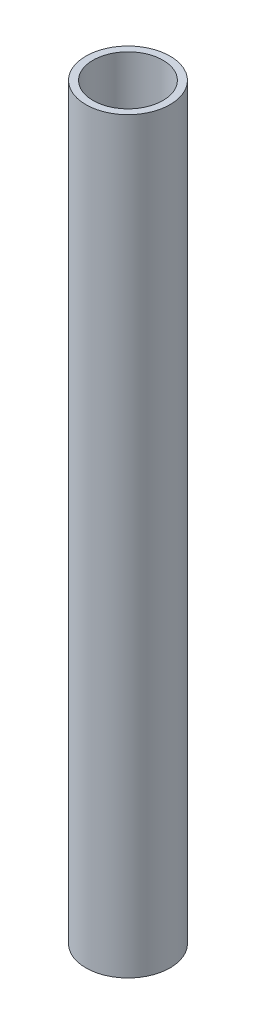
ISO-10303-21;
HEADER;
FILE_DESCRIPTION(('STEP AP214'),'2;1');
FILE_NAME('part.step','',(''),(''),'','','');
FILE_SCHEMA(('AUTOMOTIVE_DESIGN { 1 0 10303 214 1 1 1 1 }'));
ENDSEC;
DATA;
#1=APPLICATION_CONTEXT('core data for automotive mechanical design processes');
#2=APPLICATION_PROTOCOL_DEFINITION('international standard','automotive_design',2000,#1);
#3=PRODUCT_CONTEXT('',#1,'mechanical');
#4=PRODUCT('Part','Part','',(#3));
#5=PRODUCT_RELATED_PRODUCT_CATEGORY('part','',(#4));
#6=PRODUCT_DEFINITION_FORMATION('','',#4);
#7=PRODUCT_DEFINITION_CONTEXT('part definition',#1,'design');
#8=PRODUCT_DEFINITION('design','',#6,#7);
#9=PRODUCT_DEFINITION_SHAPE('','',#8);
#10=(LENGTH_UNIT() NAMED_UNIT(*) SI_UNIT(.MILLI.,.METRE.));
#11=(NAMED_UNIT(*) PLANE_ANGLE_UNIT() SI_UNIT($,.RADIAN.));
#12=(NAMED_UNIT(*) SI_UNIT($,.STERADIAN.) SOLID_ANGLE_UNIT());
#13=UNCERTAINTY_MEASURE_WITH_UNIT(LENGTH_MEASURE(1.E-05),#10,'distance_accuracy_value','');
#14=(GEOMETRIC_REPRESENTATION_CONTEXT(3) GLOBAL_UNCERTAINTY_ASSIGNED_CONTEXT((#13)) GLOBAL_UNIT_ASSIGNED_CONTEXT((#10,
#11,#12)) REPRESENTATION_CONTEXT('',''));
#15=CARTESIAN_POINT('',(0.,0.,0.));
#16=DIRECTION('',(0.,0.,1.));
#17=DIRECTION('',(1.,0.,0.));
#18=AXIS2_PLACEMENT_3D('',#15,#16,#17);
#19=CARTESIAN_POINT('',(0.,374.65,0.));
#20=DIRECTION('',(0.,1.,0.));
#21=DIRECTION('',(0.,0.,1.));
#22=AXIS2_PLACEMENT_3D('',#19,#20,#21);
#23=PLANE('',#22);
#24=CARTESIAN_POINT('',(0.,374.65,0.));
#25=DIRECTION('',(0.,1.,0.));
#26=DIRECTION('',(0.,0.,1.));
#27=AXIS2_PLACEMENT_3D('',#24,#25,#26);
#28=CIRCLE('',#27,21.082);
#29=CARTESIAN_POINT('',(0.,374.65,21.082));
#30=VERTEX_POINT('',#29);
#31=EDGE_CURVE('E10',#30,#30,#28,.T.);
#32=ORIENTED_EDGE('',*,*,#31,.T.);
#33=EDGE_LOOP('',(#32));
#34=FACE_BOUND('',#33,.T.);
#35=CARTESIAN_POINT('',(0.,374.65,0.));
#36=DIRECTION('',(0.,1.,0.));
#37=DIRECTION('',(0.,0.,1.));
#38=AXIS2_PLACEMENT_3D('',#35,#36,#37);
#39=CIRCLE('',#38,17.526);
#40=CARTESIAN_POINT('',(0.,374.65,17.526));
#41=VERTEX_POINT('',#40);
#42=EDGE_CURVE('E39',#41,#41,#39,.T.);
#43=ORIENTED_EDGE('',*,*,#42,.F.);
#44=EDGE_LOOP('',(#43));
#45=FACE_BOUND('',#44,.T.);
#46=ADVANCED_FACE('F28',(#34,#45),#23,.T.);
#47=CARTESIAN_POINT('',(0.,0.,0.));
#48=DIRECTION('',(0.,1.,0.));
#49=DIRECTION('',(0.,0.,1.));
#50=AXIS2_PLACEMENT_3D('',#47,#48,#49);
#51=PLANE('',#50);
#52=CARTESIAN_POINT('',(0.,0.,0.));
#53=DIRECTION('',(0.,1.,0.));
#54=DIRECTION('',(0.,0.,1.));
#55=AXIS2_PLACEMENT_3D('',#52,#53,#54);
#56=CIRCLE('',#55,21.082);
#57=CARTESIAN_POINT('',(0.,0.,21.082));
#58=VERTEX_POINT('',#57);
#59=EDGE_CURVE('E32',#58,#58,#56,.T.);
#60=ORIENTED_EDGE('',*,*,#59,.F.);
#61=EDGE_LOOP('',(#60));
#62=FACE_BOUND('',#61,.T.);
#63=CARTESIAN_POINT('',(0.,0.,0.));
#64=DIRECTION('',(0.,1.,0.));
#65=DIRECTION('',(0.,0.,1.));
#66=AXIS2_PLACEMENT_3D('',#63,#64,#65);
#67=CIRCLE('',#66,17.526);
#68=CARTESIAN_POINT('',(0.,0.,17.526));
#69=VERTEX_POINT('',#68);
#70=EDGE_CURVE('E41',#69,#69,#67,.T.);
#71=ORIENTED_EDGE('',*,*,#70,.T.);
#72=EDGE_LOOP('',(#71));
#73=FACE_BOUND('',#72,.T.);
#74=ADVANCED_FACE('F51',(#62,#73),#51,.F.);
#75=CARTESIAN_POINT('',(0.,374.65,0.));
#76=DIRECTION('',(0.,-1.,0.));
#77=DIRECTION('',(0.,0.,-1.));
#78=AXIS2_PLACEMENT_3D('',#75,#76,#77);
#79=CYLINDRICAL_SURFACE('',#78,21.082);
#80=ORIENTED_EDGE('',*,*,#31,.F.);
#81=EDGE_LOOP('',(#80));
#82=FACE_BOUND('',#81,.T.);
#83=ORIENTED_EDGE('',*,*,#59,.T.);
#84=EDGE_LOOP('',(#83));
#85=FACE_BOUND('',#84,.T.);
#86=ADVANCED_FACE('F30',(#82,#85),#79,.T.);
#87=CARTESIAN_POINT('',(0.,374.65,0.));
#88=DIRECTION('',(0.,-1.,0.));
#89=DIRECTION('',(0.,0.,-1.));
#90=AXIS2_PLACEMENT_3D('',#87,#88,#89);
#91=CYLINDRICAL_SURFACE('',#90,17.526);
#92=ORIENTED_EDGE('',*,*,#42,.T.);
#93=EDGE_LOOP('',(#92));
#94=FACE_BOUND('',#93,.T.);
#95=ORIENTED_EDGE('',*,*,#70,.F.);
#96=EDGE_LOOP('',(#95));
#97=FACE_BOUND('',#96,.T.);
#98=ADVANCED_FACE('F47',(#94,#97),#91,.F.);
#99=CLOSED_SHELL('',(#46,#74,#86,#98));
#100=MANIFOLD_SOLID_BREP('B2',#99);
#101=ADVANCED_BREP_SHAPE_REPRESENTATION('',(#18,#100),#14);
#102=SHAPE_DEFINITION_REPRESENTATION(#9,#101);
ENDSEC;
END-ISO-10303-21;
